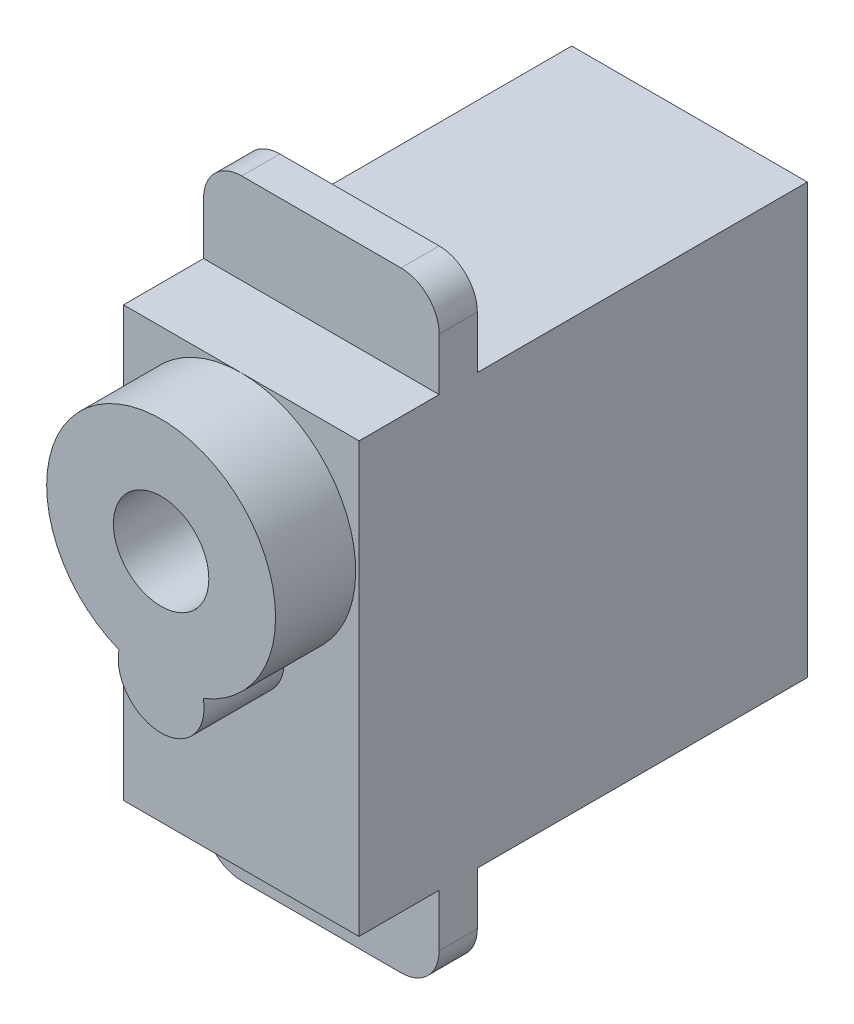
ISO-10303-21;
HEADER;
FILE_DESCRIPTION(('STEP AP214'),'2;1');
FILE_NAME('part.step','',(''),(''),'','','');
FILE_SCHEMA(('AUTOMOTIVE_DESIGN { 1 0 10303 214 1 1 1 1 }'));
ENDSEC;
DATA;
#1=APPLICATION_CONTEXT('core data for automotive mechanical design processes');
#2=APPLICATION_PROTOCOL_DEFINITION('international standard','automotive_design',2000,#1);
#3=PRODUCT_CONTEXT('',#1,'mechanical');
#4=PRODUCT('Part','Part','',(#3));
#5=PRODUCT_RELATED_PRODUCT_CATEGORY('part','',(#4));
#6=PRODUCT_DEFINITION_FORMATION('','',#4);
#7=PRODUCT_DEFINITION_CONTEXT('part definition',#1,'design');
#8=PRODUCT_DEFINITION('design','',#6,#7);
#9=PRODUCT_DEFINITION_SHAPE('','',#8);
#10=(LENGTH_UNIT() NAMED_UNIT(*) SI_UNIT(.MILLI.,.METRE.));
#11=(NAMED_UNIT(*) PLANE_ANGLE_UNIT() SI_UNIT($,.RADIAN.));
#12=(NAMED_UNIT(*) SI_UNIT($,.STERADIAN.) SOLID_ANGLE_UNIT());
#13=UNCERTAINTY_MEASURE_WITH_UNIT(LENGTH_MEASURE(1.E-05),#10,'distance_accuracy_value','');
#14=(GEOMETRIC_REPRESENTATION_CONTEXT(3) GLOBAL_UNCERTAINTY_ASSIGNED_CONTEXT((#13)) GLOBAL_UNIT_ASSIGNED_CONTEXT((#10,
#11,#12)) REPRESENTATION_CONTEXT('',''));
#15=CARTESIAN_POINT('',(0.,0.,0.));
#16=DIRECTION('',(0.,0.,1.));
#17=DIRECTION('',(1.,0.,0.));
#18=AXIS2_PLACEMENT_3D('',#15,#16,#17);
#19=CARTESIAN_POINT('',(6.175,7.58418091123829,178.866706922271));
#20=DIRECTION('',(0.,-1.,0.));
#21=DIRECTION('',(0.,0.,-1.));
#22=AXIS2_PLACEMENT_3D('',#19,#20,#21);
#23=PLANE('',#22);
#24=DIRECTION('',(-1.,0.,0.));
#25=VECTOR('',#24,1.);
#26=CARTESIAN_POINT('',(6.175,7.58418091123829,172.666706922271));
#27=LINE('',#26,#25);
#28=CARTESIAN_POINT('',(6.175,7.5841809112383,172.666706922271));
#29=VERTEX_POINT('',#28);
#30=CARTESIAN_POINT('',(-6.175,7.5841809112383,172.666706922271));
#31=VERTEX_POINT('',#30);
#32=EDGE_CURVE('E250',#29,#31,#27,.T.);
#33=ORIENTED_EDGE('',*,*,#32,.F.);
#34=DIRECTION('',(0.,0.,1.));
#35=VECTOR('',#34,1.);
#36=CARTESIAN_POINT('',(6.175,7.58418091123829,178.866706922271));
#37=LINE('',#36,#35);
#38=CARTESIAN_POINT('',(6.175,7.5841809112383,155.366706922271));
#39=VERTEX_POINT('',#38);
#40=EDGE_CURVE('E255',#39,#29,#37,.T.);
#41=ORIENTED_EDGE('',*,*,#40,.F.);
#42=DIRECTION('',(-1.,0.,0.));
#43=VECTOR('',#42,1.);
#44=CARTESIAN_POINT('',(6.175,7.5841809112383,155.366706922271));
#45=LINE('',#44,#43);
#46=CARTESIAN_POINT('',(-6.175,7.5841809112383,155.366706922271));
#47=VERTEX_POINT('',#46);
#48=EDGE_CURVE('E271',#39,#47,#45,.T.);
#49=ORIENTED_EDGE('',*,*,#48,.T.);
#50=DIRECTION('',(0.,0.,1.));
#51=VECTOR('',#50,1.);
#52=CARTESIAN_POINT('',(-6.175,7.58418091123829,178.866706922271));
#53=LINE('',#52,#51);
#54=EDGE_CURVE('E272',#47,#31,#53,.T.);
#55=ORIENTED_EDGE('',*,*,#54,.T.);
#56=EDGE_LOOP('',(#33,#41,#49,#55));
#57=FACE_BOUND('',#56,.T.);
#58=ADVANCED_FACE('F45',(#57),#23,.F.);
#59=CARTESIAN_POINT('',(6.175,-14.9158190887617,178.866706922271));
#60=DIRECTION('',(0.,1.,0.));
#61=DIRECTION('',(0.,0.,1.));
#62=AXIS2_PLACEMENT_3D('',#59,#60,#61);
#63=PLANE('',#62);
#64=DIRECTION('',(1.,0.,0.));
#65=VECTOR('',#64,1.);
#66=CARTESIAN_POINT('',(6.175,-14.9158190887617,172.666706922271));
#67=LINE('',#66,#65);
#68=CARTESIAN_POINT('',(-6.175,-14.9158190887617,172.666706922271));
#69=VERTEX_POINT('',#68);
#70=CARTESIAN_POINT('',(6.175,-14.9158190887617,172.666706922271));
#71=VERTEX_POINT('',#70);
#72=EDGE_CURVE('E246',#69,#71,#67,.T.);
#73=ORIENTED_EDGE('',*,*,#72,.F.);
#74=DIRECTION('',(0.,0.,-1.));
#75=VECTOR('',#74,1.);
#76=CARTESIAN_POINT('',(-6.175,-14.9158190887617,178.866706922271));
#77=LINE('',#76,#75);
#78=CARTESIAN_POINT('',(-6.175,-14.9158190887617,155.366706922271));
#79=VERTEX_POINT('',#78);
#80=EDGE_CURVE('E279',#69,#79,#77,.T.);
#81=ORIENTED_EDGE('',*,*,#80,.T.);
#82=DIRECTION('',(-1.,0.,0.));
#83=VECTOR('',#82,1.);
#84=CARTESIAN_POINT('',(6.175,-14.9158190887617,155.366706922271));
#85=LINE('',#84,#83);
#86=CARTESIAN_POINT('',(6.175,-14.9158190887617,155.366706922271));
#87=VERTEX_POINT('',#86);
#88=EDGE_CURVE('E290',#87,#79,#85,.T.);
#89=ORIENTED_EDGE('',*,*,#88,.F.);
#90=DIRECTION('',(0.,0.,-1.));
#91=VECTOR('',#90,1.);
#92=CARTESIAN_POINT('',(6.175,-14.9158190887617,178.866706922271));
#93=LINE('',#92,#91);
#94=EDGE_CURVE('E263',#71,#87,#93,.T.);
#95=ORIENTED_EDGE('',*,*,#94,.F.);
#96=EDGE_LOOP('',(#73,#81,#89,#95));
#97=FACE_BOUND('',#96,.T.);
#98=ADVANCED_FACE('F419',(#97),#63,.F.);
#99=CARTESIAN_POINT('',(6.175,7.5841809112383,174.666706922271));
#100=VERTEX_POINT('',#99);
#101=CARTESIAN_POINT('',(6.175,7.58418091123829,178.866706922271));
#102=VERTEX_POINT('',#101);
#103=EDGE_CURVE('E260',#100,#102,#37,.T.);
#104=ORIENTED_EDGE('',*,*,#103,.F.);
#105=DIRECTION('',(-1.,0.,0.));
#106=VECTOR('',#105,1.);
#107=CARTESIAN_POINT('',(6.175,7.58418091123829,174.666706922271));
#108=LINE('',#107,#106);
#109=CARTESIAN_POINT('',(-6.175,7.58418091123829,174.666706922271));
#110=VERTEX_POINT('',#109);
#111=EDGE_CURVE('E242',#100,#110,#108,.T.);
#112=ORIENTED_EDGE('',*,*,#111,.T.);
#113=CARTESIAN_POINT('',(-6.175,7.58418091123829,178.866706922271));
#114=VERTEX_POINT('',#113);
#115=EDGE_CURVE('E254',#110,#114,#53,.T.);
#116=ORIENTED_EDGE('',*,*,#115,.T.);
#117=DIRECTION('',(-1.,0.,0.));
#118=VECTOR('',#117,1.);
#119=CARTESIAN_POINT('',(6.175,7.58418091123829,178.866706922271));
#120=LINE('',#119,#118);
#121=CARTESIAN_POINT('',(0.,7.58418091123829,178.866706922271));
#122=VERTEX_POINT('',#121);
#123=EDGE_CURVE('E297',#122,#114,#120,.T.);
#124=ORIENTED_EDGE('',*,*,#123,.F.);
#125=EDGE_CURVE('E298',#102,#122,#120,.T.);
#126=ORIENTED_EDGE('',*,*,#125,.F.);
#127=EDGE_LOOP('',(#104,#112,#116,#124,#126));
#128=FACE_BOUND('',#127,.T.);
#129=ADVANCED_FACE('F370',(#128),#23,.F.);
#130=CARTESIAN_POINT('',(6.175,7.58418091123829,178.866706922271));
#131=DIRECTION('',(0.,0.,-1.));
#132=DIRECTION('',(-1.,0.,0.));
#133=AXIS2_PLACEMENT_3D('',#130,#131,#132);
#134=PLANE('',#133);
#135=CARTESIAN_POINT('',(0.,-4.41581908876171,178.866706922271));
#136=DIRECTION('',(0.,0.,1.));
#137=DIRECTION('',(1.,0.,0.));
#138=AXIS2_PLACEMENT_3D('',#135,#136,#137);
#139=CIRCLE('',#138,2.25);
#140=CARTESIAN_POINT('',(-2.21009535639868,-3.99394408876171,178.866706922271));
#141=VERTEX_POINT('',#140);
#142=CARTESIAN_POINT('',(2.21009535639868,-3.99394408876171,178.866706922271));
#143=VERTEX_POINT('',#142);
#144=EDGE_CURVE('E195',#141,#143,#139,.T.);
#145=ORIENTED_EDGE('',*,*,#144,.F.);
#146=CARTESIAN_POINT('',(0.,1.58418091123829,178.866706922271));
#147=DIRECTION('',(0.,0.,1.));
#148=DIRECTION('',(1.,0.,0.));
#149=AXIS2_PLACEMENT_3D('',#146,#147,#148);
#150=CIRCLE('',#149,6.);
#151=EDGE_CURVE('E302',#122,#141,#150,.T.);
#152=ORIENTED_EDGE('',*,*,#151,.F.);
#153=ORIENTED_EDGE('',*,*,#123,.T.);
#154=DIRECTION('',(0.,-1.,0.));
#155=VECTOR('',#154,1.);
#156=CARTESIAN_POINT('',(-6.175,7.58418091123829,178.866706922271));
#157=LINE('',#156,#155);
#158=CARTESIAN_POINT('',(-6.175,-14.9158190887617,178.866706922271));
#159=VERTEX_POINT('',#158);
#160=EDGE_CURVE('E276',#114,#159,#157,.T.);
#161=ORIENTED_EDGE('',*,*,#160,.T.);
#162=DIRECTION('',(-1.,0.,0.));
#163=VECTOR('',#162,1.);
#164=CARTESIAN_POINT('',(6.175,-14.9158190887617,178.866706922271));
#165=LINE('',#164,#163);
#166=CARTESIAN_POINT('',(6.175,-14.9158190887617,178.866706922271));
#167=VERTEX_POINT('',#166);
#168=EDGE_CURVE('E294',#167,#159,#165,.T.);
#169=ORIENTED_EDGE('',*,*,#168,.F.);
#170=DIRECTION('',(0.,-1.,0.));
#171=VECTOR('',#170,1.);
#172=CARTESIAN_POINT('',(6.175,7.58418091123829,178.866706922271));
#173=LINE('',#172,#171);
#174=EDGE_CURVE('E259',#102,#167,#173,.T.);
#175=ORIENTED_EDGE('',*,*,#174,.F.);
#176=ORIENTED_EDGE('',*,*,#125,.T.);
#177=EDGE_CURVE('E192',#143,#122,#150,.T.);
#178=ORIENTED_EDGE('',*,*,#177,.F.);
#179=EDGE_LOOP('',(#145,#152,#153,#161,#169,#175,#176,#178));
#180=FACE_BOUND('',#179,.T.);
#181=ADVANCED_FACE('F364',(#180),#134,.F.);
#182=CARTESIAN_POINT('',(-6.175,-14.9158190887617,174.666706922271));
#183=VERTEX_POINT('',#182);
#184=EDGE_CURVE('E280',#159,#183,#77,.T.);
#185=ORIENTED_EDGE('',*,*,#184,.T.);
#186=DIRECTION('',(1.,0.,0.));
#187=VECTOR('',#186,1.);
#188=CARTESIAN_POINT('',(6.175,-14.9158190887617,174.666706922271));
#189=LINE('',#188,#187);
#190=CARTESIAN_POINT('',(6.175,-14.9158190887617,174.666706922271));
#191=VERTEX_POINT('',#190);
#192=EDGE_CURVE('E224',#183,#191,#189,.T.);
#193=ORIENTED_EDGE('',*,*,#192,.T.);
#194=EDGE_CURVE('E264',#167,#191,#93,.T.);
#195=ORIENTED_EDGE('',*,*,#194,.F.);
#196=ORIENTED_EDGE('',*,*,#168,.T.);
#197=EDGE_LOOP('',(#185,#193,#195,#196));
#198=FACE_BOUND('',#197,.T.);
#199=ADVANCED_FACE('F369',(#198),#63,.F.);
#200=CARTESIAN_POINT('',(6.175,7.5841809112383,155.366706922271));
#201=DIRECTION('',(0.,0.,1.));
#202=DIRECTION('',(1.,0.,0.));
#203=AXIS2_PLACEMENT_3D('',#200,#201,#202);
#204=PLANE('',#203);
#205=DIRECTION('',(0.,1.,0.));
#206=VECTOR('',#205,1.);
#207=CARTESIAN_POINT('',(-6.175,7.5841809112383,155.366706922271));
#208=LINE('',#207,#206);
#209=EDGE_CURVE('E284',#79,#47,#208,.T.);
#210=ORIENTED_EDGE('',*,*,#209,.T.);
#211=ORIENTED_EDGE('',*,*,#48,.F.);
#212=DIRECTION('',(0.,1.,0.));
#213=VECTOR('',#212,1.);
#214=CARTESIAN_POINT('',(6.175,7.5841809112383,155.366706922271));
#215=LINE('',#214,#213);
#216=EDGE_CURVE('E268',#87,#39,#215,.T.);
#217=ORIENTED_EDGE('',*,*,#216,.F.);
#218=ORIENTED_EDGE('',*,*,#88,.T.);
#219=EDGE_LOOP('',(#210,#211,#217,#218));
#220=FACE_BOUND('',#219,.T.);
#221=ADVANCED_FACE('F437',(#220),#204,.F.);
#222=CARTESIAN_POINT('',(6.175,0.,0.));
#223=DIRECTION('',(-1.,0.,0.));
#224=DIRECTION('',(0.,0.,1.));
#225=AXIS2_PLACEMENT_3D('',#222,#223,#224);
#226=PLANE('',#225);
#227=DIRECTION('',(0.,1.,0.));
#228=VECTOR('',#227,1.);
#229=CARTESIAN_POINT('',(6.175,12.3341809112383,174.666706922271));
#230=LINE('',#229,#228);
#231=CARTESIAN_POINT('',(6.175,-17.6658190887617,174.666706922271));
#232=VERTEX_POINT('',#231);
#233=EDGE_CURVE('E232',#232,#191,#230,.T.);
#234=ORIENTED_EDGE('',*,*,#233,.F.);
#235=DIRECTION('',(0.,0.,1.));
#236=VECTOR('',#235,1.);
#237=CARTESIAN_POINT('',(6.175,-17.6658190887617,172.666706922271));
#238=LINE('',#237,#236);
#239=CARTESIAN_POINT('',(6.175,-17.6658190887617,172.666706922271));
#240=VERTEX_POINT('',#239);
#241=EDGE_CURVE('E319',#232,#240,#238,.F.);
#242=ORIENTED_EDGE('',*,*,#241,.T.);
#243=DIRECTION('',(0.,1.,0.));
#244=VECTOR('',#243,1.);
#245=CARTESIAN_POINT('',(6.175,12.3341809112383,172.666706922271));
#246=LINE('',#245,#244);
#247=EDGE_CURVE('E219',#240,#71,#246,.T.);
#248=ORIENTED_EDGE('',*,*,#247,.T.);
#249=ORIENTED_EDGE('',*,*,#94,.T.);
#250=ORIENTED_EDGE('',*,*,#216,.T.);
#251=ORIENTED_EDGE('',*,*,#40,.T.);
#252=CARTESIAN_POINT('',(6.175,10.3341809112383,172.666706922271));
#253=VERTEX_POINT('',#252);
#254=EDGE_CURVE('E218',#29,#253,#246,.T.);
#255=ORIENTED_EDGE('',*,*,#254,.T.);
#256=DIRECTION('',(0.,0.,1.));
#257=VECTOR('',#256,1.);
#258=CARTESIAN_POINT('',(6.175,10.3341809112383,174.666706922271));
#259=LINE('',#258,#257);
#260=CARTESIAN_POINT('',(6.175,10.3341809112383,174.666706922271));
#261=VERTEX_POINT('',#260);
#262=EDGE_CURVE('E316',#253,#261,#259,.T.);
#263=ORIENTED_EDGE('',*,*,#262,.T.);
#264=EDGE_CURVE('E231',#100,#261,#230,.T.);
#265=ORIENTED_EDGE('',*,*,#264,.F.);
#266=ORIENTED_EDGE('',*,*,#103,.T.);
#267=ORIENTED_EDGE('',*,*,#174,.T.);
#268=ORIENTED_EDGE('',*,*,#194,.T.);
#269=EDGE_LOOP('',(#234,#242,#248,#249,#250,#251,#255,#263,#265,#266,#267,#268));
#270=FACE_BOUND('',#269,.T.);
#271=ADVANCED_FACE('F354',(#270),#226,.F.);
#272=CARTESIAN_POINT('',(-6.175,0.,0.));
#273=DIRECTION('',(-1.,0.,0.));
#274=DIRECTION('',(0.,0.,1.));
#275=AXIS2_PLACEMENT_3D('',#272,#273,#274);
#276=PLANE('',#275);
#277=DIRECTION('',(0.,-1.,0.));
#278=VECTOR('',#277,1.);
#279=CARTESIAN_POINT('',(-6.175,12.3341809112383,172.666706922271));
#280=LINE('',#279,#278);
#281=CARTESIAN_POINT('',(-6.175,-17.6658190887617,172.666706922271));
#282=VERTEX_POINT('',#281);
#283=EDGE_CURVE('E214',#69,#282,#280,.T.);
#284=ORIENTED_EDGE('',*,*,#283,.T.);
#285=DIRECTION('',(0.,0.,1.));
#286=VECTOR('',#285,1.);
#287=CARTESIAN_POINT('',(-6.175,-17.6658190887617,0.));
#288=LINE('',#287,#286);
#289=CARTESIAN_POINT('',(-6.175,-17.6658190887617,174.666706922271));
#290=VERTEX_POINT('',#289);
#291=EDGE_CURVE('E329',#282,#290,#288,.T.);
#292=ORIENTED_EDGE('',*,*,#291,.T.);
#293=DIRECTION('',(0.,-1.,0.));
#294=VECTOR('',#293,1.);
#295=CARTESIAN_POINT('',(-6.175,12.3341809112383,174.666706922271));
#296=LINE('',#295,#294);
#297=EDGE_CURVE('E197',#183,#290,#296,.T.);
#298=ORIENTED_EDGE('',*,*,#297,.F.);
#299=ORIENTED_EDGE('',*,*,#184,.F.);
#300=ORIENTED_EDGE('',*,*,#160,.F.);
#301=ORIENTED_EDGE('',*,*,#115,.F.);
#302=CARTESIAN_POINT('',(-6.175,10.3341809112383,174.666706922271));
#303=VERTEX_POINT('',#302);
#304=EDGE_CURVE('E204',#303,#110,#296,.T.);
#305=ORIENTED_EDGE('',*,*,#304,.F.);
#306=DIRECTION('',(0.,0.,1.));
#307=VECTOR('',#306,1.);
#308=CARTESIAN_POINT('',(-6.175,10.3341809112383,0.));
#309=LINE('',#308,#307);
#310=CARTESIAN_POINT('',(-6.175,10.3341809112383,172.666706922271));
#311=VERTEX_POINT('',#310);
#312=EDGE_CURVE('E326',#303,#311,#309,.F.);
#313=ORIENTED_EDGE('',*,*,#312,.T.);
#314=EDGE_CURVE('E210',#311,#31,#280,.T.);
#315=ORIENTED_EDGE('',*,*,#314,.T.);
#316=ORIENTED_EDGE('',*,*,#54,.F.);
#317=ORIENTED_EDGE('',*,*,#209,.F.);
#318=ORIENTED_EDGE('',*,*,#80,.F.);
#319=EDGE_LOOP('',(#284,#292,#298,#299,#300,#301,#305,#313,#315,#316,#317,#318));
#320=FACE_BOUND('',#319,.T.);
#321=ADVANCED_FACE('F348',(#320),#276,.T.);
#322=CARTESIAN_POINT('',(-6.175,-19.6658190887617,172.666706922271));
#323=DIRECTION('',(0.,-1.,0.));
#324=DIRECTION('',(1.,0.,0.));
#325=AXIS2_PLACEMENT_3D('',#322,#323,#324);
#326=PLANE('',#325);
#327=DIRECTION('',(1.,0.,0.));
#328=VECTOR('',#327,1.);
#329=CARTESIAN_POINT('',(-6.175,-19.6658190887617,172.666706922271));
#330=LINE('',#329,#328);
#331=CARTESIAN_POINT('',(-4.175,-19.6658190887617,172.666706922271));
#332=VERTEX_POINT('',#331);
#333=CARTESIAN_POINT('',(4.175,-19.6658190887617,172.666706922271));
#334=VERTEX_POINT('',#333);
#335=EDGE_CURVE('E213',#332,#334,#330,.T.);
#336=ORIENTED_EDGE('',*,*,#335,.T.);
#337=DIRECTION('',(0.,0.,1.));
#338=VECTOR('',#337,1.);
#339=CARTESIAN_POINT('',(4.175,-19.6658190887617,174.666706922271));
#340=LINE('',#339,#338);
#341=CARTESIAN_POINT('',(4.175,-19.6658190887617,174.666706922271));
#342=VERTEX_POINT('',#341);
#343=EDGE_CURVE('E306',#334,#342,#340,.T.);
#344=ORIENTED_EDGE('',*,*,#343,.T.);
#345=DIRECTION('',(1.,0.,0.));
#346=VECTOR('',#345,1.);
#347=CARTESIAN_POINT('',(-6.175,-19.6658190887617,174.666706922271));
#348=LINE('',#347,#346);
#349=CARTESIAN_POINT('',(-4.175,-19.6658190887617,174.666706922271));
#350=VERTEX_POINT('',#349);
#351=EDGE_CURVE('E227',#350,#342,#348,.T.);
#352=ORIENTED_EDGE('',*,*,#351,.F.);
#353=DIRECTION('',(0.,0.,1.));
#354=VECTOR('',#353,1.);
#355=CARTESIAN_POINT('',(-4.175,-19.6658190887617,172.666706922271));
#356=LINE('',#355,#354);
#357=EDGE_CURVE('E303',#350,#332,#356,.F.);
#358=ORIENTED_EDGE('',*,*,#357,.T.);
#359=EDGE_LOOP('',(#336,#344,#352,#358));
#360=FACE_BOUND('',#359,.T.);
#361=ADVANCED_FACE('F353',(#360),#326,.T.);
#362=CARTESIAN_POINT('',(0.,0.,172.666706922271));
#363=DIRECTION('',(0.,0.,1.));
#364=DIRECTION('',(1.,0.,0.));
#365=AXIS2_PLACEMENT_3D('',#362,#363,#364);
#366=PLANE('',#365);
#367=ORIENTED_EDGE('',*,*,#247,.F.);
#368=CARTESIAN_POINT('',(4.175,-17.6658190887617,172.666706922271));
#369=DIRECTION('',(0.,0.,1.));
#370=DIRECTION('',(1.,0.,0.));
#371=AXIS2_PLACEMENT_3D('',#368,#369,#370);
#372=CIRCLE('',#371,2.);
#373=EDGE_CURVE('E323',#240,#334,#372,.F.);
#374=ORIENTED_EDGE('',*,*,#373,.T.);
#375=ORIENTED_EDGE('',*,*,#335,.F.);
#376=CARTESIAN_POINT('',(-4.175,-17.6658190887617,172.666706922271));
#377=DIRECTION('',(0.,0.,1.));
#378=DIRECTION('',(1.,0.,0.));
#379=AXIS2_PLACEMENT_3D('',#376,#377,#378);
#380=CIRCLE('',#379,2.);
#381=EDGE_CURVE('E321',#332,#282,#380,.F.);
#382=ORIENTED_EDGE('',*,*,#381,.T.);
#383=ORIENTED_EDGE('',*,*,#283,.F.);
#384=ORIENTED_EDGE('',*,*,#72,.T.);
#385=EDGE_LOOP('',(#367,#374,#375,#382,#383,#384));
#386=FACE_BOUND('',#385,.T.);
#387=ADVANCED_FACE('F478',(#386),#366,.F.);
#388=CARTESIAN_POINT('',(0.,0.,174.666706922271));
#389=DIRECTION('',(0.,0.,1.));
#390=DIRECTION('',(1.,0.,0.));
#391=AXIS2_PLACEMENT_3D('',#388,#389,#390);
#392=PLANE('',#391);
#393=ORIENTED_EDGE('',*,*,#351,.T.);
#394=CARTESIAN_POINT('',(4.175,-17.6658190887617,174.666706922271));
#395=DIRECTION('',(0.,0.,1.));
#396=DIRECTION('',(1.,0.,0.));
#397=AXIS2_PLACEMENT_3D('',#394,#395,#396);
#398=CIRCLE('',#397,2.);
#399=EDGE_CURVE('E313',#342,#232,#398,.T.);
#400=ORIENTED_EDGE('',*,*,#399,.T.);
#401=ORIENTED_EDGE('',*,*,#233,.T.);
#402=ORIENTED_EDGE('',*,*,#192,.F.);
#403=ORIENTED_EDGE('',*,*,#297,.T.);
#404=CARTESIAN_POINT('',(-4.175,-17.6658190887617,174.666706922271));
#405=DIRECTION('',(0.,0.,1.));
#406=DIRECTION('',(1.,0.,0.));
#407=AXIS2_PLACEMENT_3D('',#404,#405,#406);
#408=CIRCLE('',#407,2.);
#409=EDGE_CURVE('E310',#290,#350,#408,.T.);
#410=ORIENTED_EDGE('',*,*,#409,.T.);
#411=EDGE_LOOP('',(#393,#400,#401,#402,#403,#410));
#412=FACE_BOUND('',#411,.T.);
#413=ADVANCED_FACE('F388',(#412),#392,.T.);
#414=DIRECTION('',(-1.,0.,0.));
#415=VECTOR('',#414,1.);
#416=CARTESIAN_POINT('',(-6.175,12.3341809112383,172.666706922271));
#417=LINE('',#416,#415);
#418=CARTESIAN_POINT('',(4.175,12.3341809112383,172.666706922271));
#419=VERTEX_POINT('',#418);
#420=CARTESIAN_POINT('',(-4.175,12.3341809112383,172.666706922271));
#421=VERTEX_POINT('',#420);
#422=EDGE_CURVE('E222',#419,#421,#417,.T.);
#423=ORIENTED_EDGE('',*,*,#422,.F.);
#424=CARTESIAN_POINT('',(4.175,10.3341809112383,172.666706922271));
#425=DIRECTION('',(0.,0.,1.));
#426=DIRECTION('',(1.,0.,0.));
#427=AXIS2_PLACEMENT_3D('',#424,#425,#426);
#428=CIRCLE('',#427,2.);
#429=EDGE_CURVE('E11',#419,#253,#428,.F.);
#430=ORIENTED_EDGE('',*,*,#429,.T.);
#431=ORIENTED_EDGE('',*,*,#254,.F.);
#432=ORIENTED_EDGE('',*,*,#32,.T.);
#433=ORIENTED_EDGE('',*,*,#314,.F.);
#434=CARTESIAN_POINT('',(-4.175,10.3341809112383,172.666706922271));
#435=DIRECTION('',(0.,0.,1.));
#436=DIRECTION('',(1.,0.,0.));
#437=AXIS2_PLACEMENT_3D('',#434,#435,#436);
#438=CIRCLE('',#437,2.);
#439=EDGE_CURVE('E54',#311,#421,#438,.F.);
#440=ORIENTED_EDGE('',*,*,#439,.T.);
#441=EDGE_LOOP('',(#423,#430,#431,#432,#433,#440));
#442=FACE_BOUND('',#441,.T.);
#443=ADVANCED_FACE('F385',(#442),#366,.F.);
#444=ORIENTED_EDGE('',*,*,#264,.T.);
#445=CARTESIAN_POINT('',(4.175,10.3341809112383,174.666706922271));
#446=DIRECTION('',(0.,0.,1.));
#447=DIRECTION('',(1.,0.,0.));
#448=AXIS2_PLACEMENT_3D('',#445,#446,#447);
#449=CIRCLE('',#448,2.);
#450=CARTESIAN_POINT('',(4.175,12.3341809112383,174.666706922271));
#451=VERTEX_POINT('',#450);
#452=EDGE_CURVE('E336',#261,#451,#449,.T.);
#453=ORIENTED_EDGE('',*,*,#452,.T.);
#454=DIRECTION('',(-1.,0.,0.));
#455=VECTOR('',#454,1.);
#456=CARTESIAN_POINT('',(-6.175,12.3341809112383,174.666706922271));
#457=LINE('',#456,#455);
#458=CARTESIAN_POINT('',(-4.175,12.3341809112383,174.666706922271));
#459=VERTEX_POINT('',#458);
#460=EDGE_CURVE('E235',#451,#459,#457,.T.);
#461=ORIENTED_EDGE('',*,*,#460,.T.);
#462=CARTESIAN_POINT('',(-4.175,10.3341809112383,174.666706922271));
#463=DIRECTION('',(0.,0.,1.));
#464=DIRECTION('',(1.,0.,0.));
#465=AXIS2_PLACEMENT_3D('',#462,#463,#464);
#466=CIRCLE('',#465,2.);
#467=EDGE_CURVE('E333',#459,#303,#466,.T.);
#468=ORIENTED_EDGE('',*,*,#467,.T.);
#469=ORIENTED_EDGE('',*,*,#304,.T.);
#470=ORIENTED_EDGE('',*,*,#111,.F.);
#471=EDGE_LOOP('',(#444,#453,#461,#468,#469,#470));
#472=FACE_BOUND('',#471,.T.);
#473=ADVANCED_FACE('F380',(#472),#392,.T.);
#474=CARTESIAN_POINT('',(-6.175,12.3341809112383,172.666706922271));
#475=DIRECTION('',(0.,1.,0.));
#476=DIRECTION('',(0.,0.,1.));
#477=AXIS2_PLACEMENT_3D('',#474,#475,#476);
#478=PLANE('',#477);
#479=ORIENTED_EDGE('',*,*,#460,.F.);
#480=DIRECTION('',(0.,0.,1.));
#481=VECTOR('',#480,1.);
#482=CARTESIAN_POINT('',(4.175,12.3341809112383,172.666706922271));
#483=LINE('',#482,#481);
#484=EDGE_CURVE('E67',#451,#419,#483,.F.);
#485=ORIENTED_EDGE('',*,*,#484,.T.);
#486=ORIENTED_EDGE('',*,*,#422,.T.);
#487=DIRECTION('',(0.,0.,1.));
#488=VECTOR('',#487,1.);
#489=CARTESIAN_POINT('',(-4.175,12.3341809112383,172.666706922271));
#490=LINE('',#489,#488);
#491=EDGE_CURVE('E339',#421,#459,#490,.T.);
#492=ORIENTED_EDGE('',*,*,#491,.T.);
#493=EDGE_LOOP('',(#479,#485,#486,#492));
#494=FACE_BOUND('',#493,.T.);
#495=ADVANCED_FACE('F384',(#494),#478,.T.);
#496=CARTESIAN_POINT('',(0.,-4.41581908876171,183.066706922271));
#497=DIRECTION('',(0.,0.,-1.));
#498=DIRECTION('',(-1.,0.,0.));
#499=AXIS2_PLACEMENT_3D('',#496,#497,#498);
#500=CYLINDRICAL_SURFACE('',#499,2.25);
#501=ORIENTED_EDGE('',*,*,#144,.T.);
#502=DIRECTION('',(0.,0.,-1.));
#503=VECTOR('',#502,1.);
#504=CARTESIAN_POINT('',(2.21009535639868,-3.99394408876171,183.066706922271));
#505=LINE('',#504,#503);
#506=CARTESIAN_POINT('',(2.21009535639868,-3.99394408876171,183.066706922271));
#507=VERTEX_POINT('',#506);
#508=EDGE_CURVE('E179',#507,#143,#505,.T.);
#509=ORIENTED_EDGE('',*,*,#508,.F.);
#510=CARTESIAN_POINT('',(0.,-4.41581908876171,183.066706922271));
#511=DIRECTION('',(0.,0.,1.));
#512=DIRECTION('',(1.,0.,0.));
#513=AXIS2_PLACEMENT_3D('',#510,#511,#512);
#514=CIRCLE('',#513,2.25);
#515=CARTESIAN_POINT('',(-2.21009535639868,-3.99394408876171,183.066706922271));
#516=VERTEX_POINT('',#515);
#517=EDGE_CURVE('E187',#516,#507,#514,.T.);
#518=ORIENTED_EDGE('',*,*,#517,.F.);
#519=DIRECTION('',(0.,0.,-1.));
#520=VECTOR('',#519,1.);
#521=CARTESIAN_POINT('',(-2.21009535639868,-3.99394408876171,183.066706922271));
#522=LINE('',#521,#520);
#523=EDGE_CURVE('E183',#516,#141,#522,.T.);
#524=ORIENTED_EDGE('',*,*,#523,.T.);
#525=EDGE_LOOP('',(#501,#509,#518,#524));
#526=FACE_BOUND('',#525,.T.);
#527=ADVANCED_FACE('F194',(#526),#500,.T.);
#528=CARTESIAN_POINT('',(0.,1.58418091123829,183.066706922271));
#529=DIRECTION('',(0.,0.,-1.));
#530=DIRECTION('',(-1.,0.,0.));
#531=AXIS2_PLACEMENT_3D('',#528,#529,#530);
#532=CYLINDRICAL_SURFACE('',#531,6.);
#533=ORIENTED_EDGE('',*,*,#177,.T.);
#534=ORIENTED_EDGE('',*,*,#151,.T.);
#535=ORIENTED_EDGE('',*,*,#523,.F.);
#536=CARTESIAN_POINT('',(0.,1.58418091123829,183.066706922271));
#537=DIRECTION('',(0.,0.,1.));
#538=DIRECTION('',(1.,0.,0.));
#539=AXIS2_PLACEMENT_3D('',#536,#537,#538);
#540=CIRCLE('',#539,6.);
#541=EDGE_CURVE('E174',#507,#516,#540,.T.);
#542=ORIENTED_EDGE('',*,*,#541,.F.);
#543=ORIENTED_EDGE('',*,*,#508,.T.);
#544=EDGE_LOOP('',(#533,#534,#535,#542,#543));
#545=FACE_BOUND('',#544,.T.);
#546=ADVANCED_FACE('F177',(#545),#532,.T.);
#547=CARTESIAN_POINT('',(0.,-1.41581908876171,183.066706922271));
#548=DIRECTION('',(0.,0.,1.));
#549=DIRECTION('',(1.,0.,0.));
#550=AXIS2_PLACEMENT_3D('',#547,#548,#549);
#551=PLANE('',#550);
#552=CARTESIAN_POINT('',(0.,1.58418091123829,183.066706922271));
#553=DIRECTION('',(0.,0.,1.));
#554=DIRECTION('',(1.,0.,0.));
#555=AXIS2_PLACEMENT_3D('',#552,#553,#554);
#556=CIRCLE('',#555,2.5);
#557=CARTESIAN_POINT('',(2.5,1.58418091123829,183.066706922271));
#558=VERTEX_POINT('',#557);
#559=EDGE_CURVE('E489',#558,#558,#556,.T.);
#560=ORIENTED_EDGE('',*,*,#559,.F.);
#561=EDGE_LOOP('',(#560));
#562=FACE_BOUND('',#561,.T.);
#563=ORIENTED_EDGE('',*,*,#517,.T.);
#564=ORIENTED_EDGE('',*,*,#541,.T.);
#565=EDGE_LOOP('',(#563,#564));
#566=FACE_BOUND('',#565,.T.);
#567=ADVANCED_FACE('F189',(#562,#566),#551,.T.);
#568=CARTESIAN_POINT('',(0.,1.58418091123829,178.866706922271));
#569=DIRECTION('',(0.,0.,1.));
#570=DIRECTION('',(1.,0.,0.));
#571=AXIS2_PLACEMENT_3D('',#568,#569,#570);
#572=CYLINDRICAL_SURFACE('',#571,2.5);
#573=CARTESIAN_POINT('',(0.,1.58418091123829,178.866706922271));
#574=DIRECTION('',(0.,0.,1.));
#575=DIRECTION('',(1.,0.,0.));
#576=AXIS2_PLACEMENT_3D('',#573,#574,#575);
#577=CIRCLE('',#576,2.5);
#578=CARTESIAN_POINT('',(2.5,1.58418091123829,178.866706922271));
#579=VERTEX_POINT('',#578);
#580=EDGE_CURVE('E410',#579,#579,#577,.T.);
#581=ORIENTED_EDGE('',*,*,#580,.F.);
#582=EDGE_LOOP('',(#581));
#583=FACE_BOUND('',#582,.T.);
#584=ORIENTED_EDGE('',*,*,#559,.T.);
#585=EDGE_LOOP('',(#584));
#586=FACE_BOUND('',#585,.T.);
#587=ADVANCED_FACE('F617',(#583,#586),#572,.F.);
#588=CARTESIAN_POINT('',(0.,1.58418091123829,178.866706922271));
#589=DIRECTION('',(0.,0.,1.));
#590=DIRECTION('',(1.,0.,0.));
#591=AXIS2_PLACEMENT_3D('',#588,#589,#590);
#592=PLANE('',#591);
#593=ORIENTED_EDGE('',*,*,#580,.T.);
#594=EDGE_LOOP('',(#593));
#595=FACE_BOUND('',#594,.T.);
#596=ADVANCED_FACE('F522',(#595),#592,.T.);
#597=CARTESIAN_POINT('',(4.175,-17.6658190887617,172.666706922271));
#598=DIRECTION('',(0.,0.,-1.));
#599=DIRECTION('',(-1.,0.,0.));
#600=AXIS2_PLACEMENT_3D('',#597,#598,#599);
#601=CYLINDRICAL_SURFACE('',#600,2.);
#602=ORIENTED_EDGE('',*,*,#373,.F.);
#603=ORIENTED_EDGE('',*,*,#241,.F.);
#604=ORIENTED_EDGE('',*,*,#399,.F.);
#605=ORIENTED_EDGE('',*,*,#343,.F.);
#606=EDGE_LOOP('',(#602,#603,#604,#605));
#607=FACE_BOUND('',#606,.T.);
#608=ADVANCED_FACE('F510',(#607),#601,.T.);
#609=CARTESIAN_POINT('',(-4.175,-17.6658190887617,0.));
#610=DIRECTION('',(0.,0.,1.));
#611=DIRECTION('',(1.,0.,0.));
#612=AXIS2_PLACEMENT_3D('',#609,#610,#611);
#613=CYLINDRICAL_SURFACE('',#612,2.);
#614=ORIENTED_EDGE('',*,*,#381,.F.);
#615=ORIENTED_EDGE('',*,*,#357,.F.);
#616=ORIENTED_EDGE('',*,*,#409,.F.);
#617=ORIENTED_EDGE('',*,*,#291,.F.);
#618=EDGE_LOOP('',(#614,#615,#616,#617));
#619=FACE_BOUND('',#618,.T.);
#620=ADVANCED_FACE('F504',(#619),#613,.T.);
#621=CARTESIAN_POINT('',(4.175,10.3341809112383,0.));
#622=DIRECTION('',(0.,0.,-1.));
#623=DIRECTION('',(-1.,0.,0.));
#624=AXIS2_PLACEMENT_3D('',#621,#622,#623);
#625=CYLINDRICAL_SURFACE('',#624,2.);
#626=ORIENTED_EDGE('',*,*,#429,.F.);
#627=ORIENTED_EDGE('',*,*,#484,.F.);
#628=ORIENTED_EDGE('',*,*,#452,.F.);
#629=ORIENTED_EDGE('',*,*,#262,.F.);
#630=EDGE_LOOP('',(#626,#627,#628,#629));
#631=FACE_BOUND('',#630,.T.);
#632=ADVANCED_FACE('F509',(#631),#625,.T.);
#633=CARTESIAN_POINT('',(-4.175,10.3341809112383,172.666706922271));
#634=DIRECTION('',(0.,0.,1.));
#635=DIRECTION('',(1.,0.,0.));
#636=AXIS2_PLACEMENT_3D('',#633,#634,#635);
#637=CYLINDRICAL_SURFACE('',#636,2.);
#638=ORIENTED_EDGE('',*,*,#439,.F.);
#639=ORIENTED_EDGE('',*,*,#312,.F.);
#640=ORIENTED_EDGE('',*,*,#467,.F.);
#641=ORIENTED_EDGE('',*,*,#491,.F.);
#642=EDGE_LOOP('',(#638,#639,#640,#641));
#643=FACE_BOUND('',#642,.T.);
#644=ADVANCED_FACE('F47',(#643),#637,.T.);
#645=CLOSED_SHELL('',(#58,#98,#129,#181,#199,#221,#271,#321,#361,#387,#413,#443,#473,#495,#527,
#546,#567,#587,#596,#608,#620,#632,#644));
#646=MANIFOLD_SOLID_BREP('B2',#645);
#647=ADVANCED_BREP_SHAPE_REPRESENTATION('',(#18,#646),#14);
#648=SHAPE_DEFINITION_REPRESENTATION(#9,#647);
ENDSEC;
END-ISO-10303-21;
